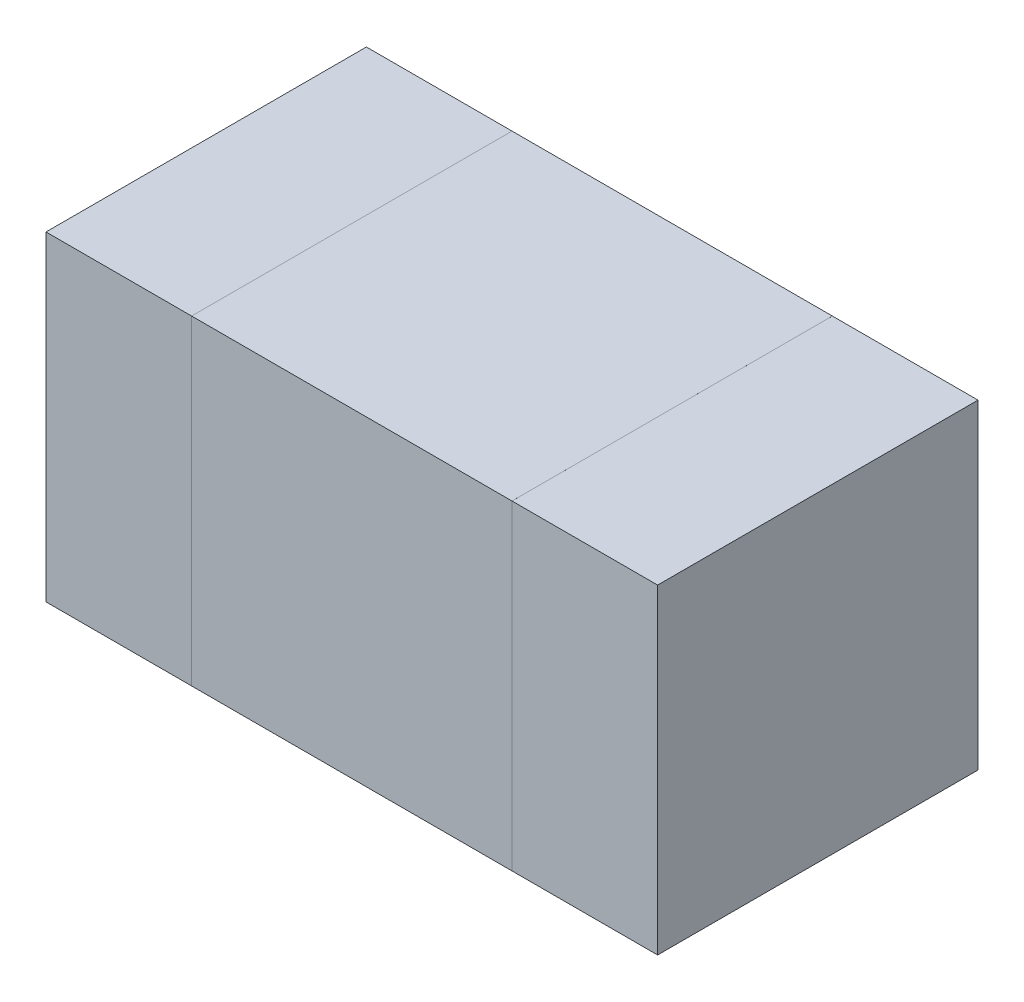
ISO-10303-21;
HEADER;
FILE_DESCRIPTION(('STEP AP214'),'2;1');
FILE_NAME('part.step','',(''),(''),'','','');
FILE_SCHEMA(('AUTOMOTIVE_DESIGN { 1 0 10303 214 1 1 1 1 }'));
ENDSEC;
DATA;
#1=APPLICATION_CONTEXT('core data for automotive mechanical design processes');
#2=APPLICATION_PROTOCOL_DEFINITION('international standard','automotive_design',2000,#1);
#3=PRODUCT_CONTEXT('',#1,'mechanical');
#4=PRODUCT('Part','Part','',(#3));
#5=PRODUCT_RELATED_PRODUCT_CATEGORY('part','',(#4));
#6=PRODUCT_DEFINITION_FORMATION('','',#4);
#7=PRODUCT_DEFINITION_CONTEXT('part definition',#1,'design');
#8=PRODUCT_DEFINITION('design','',#6,#7);
#9=PRODUCT_DEFINITION_SHAPE('','',#8);
#10=(LENGTH_UNIT() NAMED_UNIT(*) SI_UNIT(.MILLI.,.METRE.));
#11=(NAMED_UNIT(*) PLANE_ANGLE_UNIT() SI_UNIT($,.RADIAN.));
#12=(NAMED_UNIT(*) SI_UNIT($,.STERADIAN.) SOLID_ANGLE_UNIT());
#13=UNCERTAINTY_MEASURE_WITH_UNIT(LENGTH_MEASURE(1.E-05),#10,'distance_accuracy_value','');
#14=(GEOMETRIC_REPRESENTATION_CONTEXT(3) GLOBAL_UNCERTAINTY_ASSIGNED_CONTEXT((#13)) GLOBAL_UNIT_ASSIGNED_CONTEXT((#10,
#11,#12)) REPRESENTATION_CONTEXT('',''));
#15=CARTESIAN_POINT('',(0.,0.,0.));
#16=DIRECTION('',(0.,0.,1.));
#17=DIRECTION('',(1.,0.,0.));
#18=AXIS2_PLACEMENT_3D('',#15,#16,#17);
#19=CARTESIAN_POINT('',(5.860005851563,9.384998946074,0.32999934));
#20=DIRECTION('',(0.,0.,-1.));
#21=DIRECTION('',(0.,-1.,0.));
#22=AXIS2_PLACEMENT_3D('',#19,#20,#21);
#23=PLANE('',#22);
#24=DIRECTION('',(0.,1.,0.));
#25=VECTOR('',#24,1.);
#26=CARTESIAN_POINT('',(5.860005851563,9.384998946074,0.32999934));
#27=LINE('',#26,#25);
#28=CARTESIAN_POINT('',(5.860005851563,9.384998946074,0.32999934));
#29=VERTEX_POINT('',#28);
#30=CARTESIAN_POINT('',(5.860005851563,9.715000826074,0.32999934));
#31=VERTEX_POINT('',#30);
#32=EDGE_CURVE('P0_E97',#29,#31,#27,.T.);
#33=ORIENTED_EDGE('',*,*,#32,.T.);
#34=DIRECTION('',(-1.,0.,0.));
#35=VECTOR('',#34,1.);
#36=CARTESIAN_POINT('',(5.860005851563,9.715000826074,0.32999934));
#37=LINE('',#36,#35);
#38=CARTESIAN_POINT('',(5.710003611563,9.715000826074,0.32999934));
#39=VERTEX_POINT('',#38);
#40=EDGE_CURVE('P0_E77',#31,#39,#37,.T.);
#41=ORIENTED_EDGE('',*,*,#40,.T.);
#42=DIRECTION('',(0.,-1.,0.));
#43=VECTOR('',#42,1.);
#44=CARTESIAN_POINT('',(5.710003611563,9.715000826074,0.32999934));
#45=LINE('',#44,#43);
#46=CARTESIAN_POINT('',(5.710003611563,9.384998946074,0.32999934));
#47=VERTEX_POINT('',#46);
#48=EDGE_CURVE('P0_E82',#39,#47,#45,.T.);
#49=ORIENTED_EDGE('',*,*,#48,.T.);
#50=DIRECTION('',(1.,0.,0.));
#51=VECTOR('',#50,1.);
#52=CARTESIAN_POINT('',(5.710003611563,9.384998946074,0.32999934));
#53=LINE('',#52,#51);
#54=EDGE_CURVE('P0_E11',#47,#29,#53,.T.);
#55=ORIENTED_EDGE('',*,*,#54,.T.);
#56=EDGE_LOOP('',(#33,#41,#49,#55));
#57=FACE_BOUND('',#56,.T.);
#58=ADVANCED_FACE('P0_F17',(#57),#23,.F.);
#59=CARTESIAN_POINT('',(5.860005851563,9.384998946074,0.));
#60=DIRECTION('',(0.,0.,-1.));
#61=DIRECTION('',(0.,-1.,0.));
#62=AXIS2_PLACEMENT_3D('',#59,#60,#61);
#63=PLANE('',#62);
#64=DIRECTION('',(1.,0.,0.));
#65=VECTOR('',#64,1.);
#66=CARTESIAN_POINT('',(5.710003611563,9.384998946074,0.));
#67=LINE('',#66,#65);
#68=CARTESIAN_POINT('',(5.710003611563,9.384998946074,0.));
#69=VERTEX_POINT('',#68);
#70=CARTESIAN_POINT('',(5.860005851563,9.384998946074,0.));
#71=VERTEX_POINT('',#70);
#72=EDGE_CURVE('P0_E25',#69,#71,#67,.T.);
#73=ORIENTED_EDGE('',*,*,#72,.F.);
#74=DIRECTION('',(0.,-1.,0.));
#75=VECTOR('',#74,1.);
#76=CARTESIAN_POINT('',(5.710003611563,9.715000826074,0.));
#77=LINE('',#76,#75);
#78=CARTESIAN_POINT('',(5.710003611563,9.715000826074,0.));
#79=VERTEX_POINT('',#78);
#80=EDGE_CURVE('P0_E67',#79,#69,#77,.T.);
#81=ORIENTED_EDGE('',*,*,#80,.F.);
#82=DIRECTION('',(-1.,0.,0.));
#83=VECTOR('',#82,1.);
#84=CARTESIAN_POINT('',(5.860005851563,9.715000826074,0.));
#85=LINE('',#84,#83);
#86=CARTESIAN_POINT('',(5.860005851563,9.715000826074,0.));
#87=VERTEX_POINT('',#86);
#88=EDGE_CURVE('P0_E71',#87,#79,#85,.T.);
#89=ORIENTED_EDGE('',*,*,#88,.F.);
#90=DIRECTION('',(0.,1.,0.));
#91=VECTOR('',#90,1.);
#92=CARTESIAN_POINT('',(5.860005851563,9.384998946074,0.));
#93=LINE('',#92,#91);
#94=EDGE_CURVE('P0_E101',#71,#87,#93,.T.);
#95=ORIENTED_EDGE('',*,*,#94,.F.);
#96=EDGE_LOOP('',(#73,#81,#89,#95));
#97=FACE_BOUND('',#96,.T.);
#98=ADVANCED_FACE('P0_F69',(#97),#63,.T.);
#99=CARTESIAN_POINT('',(5.710003611563,9.384998946074,0.));
#100=DIRECTION('',(0.,1.,0.));
#101=DIRECTION('',(1.,0.,0.));
#102=AXIS2_PLACEMENT_3D('',#99,#100,#101);
#103=PLANE('',#102);
#104=ORIENTED_EDGE('',*,*,#72,.T.);
#105=DIRECTION('',(0.,0.,1.));
#106=VECTOR('',#105,1.);
#107=CARTESIAN_POINT('',(5.860005851563,9.384998946074,0.));
#108=LINE('',#107,#106);
#109=EDGE_CURVE('P0_E92',#71,#29,#108,.T.);
#110=ORIENTED_EDGE('',*,*,#109,.T.);
#111=ORIENTED_EDGE('',*,*,#54,.F.);
#112=DIRECTION('',(0.,0.,1.));
#113=VECTOR('',#112,1.);
#114=CARTESIAN_POINT('',(5.710003611563,9.384998946074,0.));
#115=LINE('',#114,#113);
#116=EDGE_CURVE('P0_E76',#69,#47,#115,.T.);
#117=ORIENTED_EDGE('',*,*,#116,.F.);
#118=EDGE_LOOP('',(#104,#110,#111,#117));
#119=FACE_BOUND('',#118,.T.);
#120=ADVANCED_FACE('P0_F115',(#119),#103,.F.);
#121=CARTESIAN_POINT('',(5.710003611563,9.715000826074,0.));
#122=DIRECTION('',(1.,0.,0.));
#123=DIRECTION('',(0.,1.,0.));
#124=AXIS2_PLACEMENT_3D('',#121,#122,#123);
#125=PLANE('',#124);
#126=ORIENTED_EDGE('',*,*,#80,.T.);
#127=ORIENTED_EDGE('',*,*,#116,.T.);
#128=ORIENTED_EDGE('',*,*,#48,.F.);
#129=DIRECTION('',(0.,0.,1.));
#130=VECTOR('',#129,1.);
#131=CARTESIAN_POINT('',(5.710003611563,9.715000826074,0.));
#132=LINE('',#131,#130);
#133=EDGE_CURVE('P0_E80',#79,#39,#132,.T.);
#134=ORIENTED_EDGE('',*,*,#133,.F.);
#135=EDGE_LOOP('',(#126,#127,#128,#134));
#136=FACE_BOUND('',#135,.T.);
#137=ADVANCED_FACE('P0_F81',(#136),#125,.F.);
#138=CARTESIAN_POINT('',(5.860005851563,9.715000826074,0.));
#139=DIRECTION('',(0.,-1.,0.));
#140=DIRECTION('',(0.,0.,-1.));
#141=AXIS2_PLACEMENT_3D('',#138,#139,#140);
#142=PLANE('',#141);
#143=ORIENTED_EDGE('',*,*,#88,.T.);
#144=ORIENTED_EDGE('',*,*,#133,.T.);
#145=ORIENTED_EDGE('',*,*,#40,.F.);
#146=DIRECTION('',(0.,0.,1.));
#147=VECTOR('',#146,1.);
#148=CARTESIAN_POINT('',(5.860005851563,9.715000826074,0.));
#149=LINE('',#148,#147);
#150=EDGE_CURVE('P0_E89',#87,#31,#149,.T.);
#151=ORIENTED_EDGE('',*,*,#150,.F.);
#152=EDGE_LOOP('',(#143,#144,#145,#151));
#153=FACE_BOUND('',#152,.T.);
#154=ADVANCED_FACE('P0_F87',(#153),#142,.F.);
#155=CARTESIAN_POINT('',(5.860005851563,9.384998946074,0.));
#156=DIRECTION('',(-1.,0.,0.));
#157=DIRECTION('',(0.,0.,1.));
#158=AXIS2_PLACEMENT_3D('',#155,#156,#157);
#159=PLANE('',#158);
#160=ORIENTED_EDGE('',*,*,#94,.T.);
#161=ORIENTED_EDGE('',*,*,#150,.T.);
#162=ORIENTED_EDGE('',*,*,#32,.F.);
#163=ORIENTED_EDGE('',*,*,#109,.F.);
#164=EDGE_LOOP('',(#160,#161,#162,#163));
#165=FACE_BOUND('',#164,.T.);
#166=ADVANCED_FACE('P0_F118',(#165),#159,.F.);
#167=CLOSED_SHELL('',(#58,#98,#120,#137,#154,#166));
#168=MANIFOLD_SOLID_BREP('P0_B1',#167);
#169=CARTESIAN_POINT('',(6.340001579102,9.384998946074,0.32999934));
#170=DIRECTION('',(0.,0.,-1.));
#171=DIRECTION('',(0.,-1.,0.));
#172=AXIS2_PLACEMENT_3D('',#169,#170,#171);
#173=PLANE('',#172);
#174=DIRECTION('',(0.,1.,0.));
#175=VECTOR('',#174,1.);
#176=CARTESIAN_POINT('',(6.340001579102,9.384998946074,0.32999934));
#177=LINE('',#176,#175);
#178=CARTESIAN_POINT('',(6.340001579102,9.384998946074,0.32999934));
#179=VERTEX_POINT('',#178);
#180=CARTESIAN_POINT('',(6.340001579102,9.715000826074,0.32999934));
#181=VERTEX_POINT('',#180);
#182=EDGE_CURVE('P1_E83',#179,#181,#177,.T.);
#183=ORIENTED_EDGE('',*,*,#182,.T.);
#184=DIRECTION('',(-1.,0.,0.));
#185=VECTOR('',#184,1.);
#186=CARTESIAN_POINT('',(6.340001579102,9.715000826074,0.32999934));
#187=LINE('',#186,#185);
#188=CARTESIAN_POINT('',(6.189999339102,9.715000826074,0.32999934));
#189=VERTEX_POINT('',#188);
#190=EDGE_CURVE('P1_E105',#181,#189,#187,.T.);
#191=ORIENTED_EDGE('',*,*,#190,.T.);
#192=DIRECTION('',(0.,-1.,0.));
#193=VECTOR('',#192,1.);
#194=CARTESIAN_POINT('',(6.189999339102,9.715000826074,0.32999934));
#195=LINE('',#194,#193);
#196=CARTESIAN_POINT('',(6.189999339102,9.384998946074,0.32999934));
#197=VERTEX_POINT('',#196);
#198=EDGE_CURVE('P1_E20',#189,#197,#195,.T.);
#199=ORIENTED_EDGE('',*,*,#198,.T.);
#200=DIRECTION('',(1.,0.,0.));
#201=VECTOR('',#200,1.);
#202=CARTESIAN_POINT('',(6.189999339102,9.384998946074,0.32999934));
#203=LINE('',#202,#201);
#204=EDGE_CURVE('P1_E11',#197,#179,#203,.T.);
#205=ORIENTED_EDGE('',*,*,#204,.T.);
#206=EDGE_LOOP('',(#183,#191,#199,#205));
#207=FACE_BOUND('',#206,.T.);
#208=ADVANCED_FACE('P1_F17',(#207),#173,.F.);
#209=CARTESIAN_POINT('',(6.340001579102,9.384998946074,0.));
#210=DIRECTION('',(0.,0.,-1.));
#211=DIRECTION('',(0.,-1.,0.));
#212=AXIS2_PLACEMENT_3D('',#209,#210,#211);
#213=PLANE('',#212);
#214=DIRECTION('',(1.,0.,0.));
#215=VECTOR('',#214,1.);
#216=CARTESIAN_POINT('',(6.189999339102,9.384998946074,0.));
#217=LINE('',#216,#215);
#218=CARTESIAN_POINT('',(6.189999339102,9.384998946074,0.));
#219=VERTEX_POINT('',#218);
#220=CARTESIAN_POINT('',(6.340001579102,9.384998946074,0.));
#221=VERTEX_POINT('',#220);
#222=EDGE_CURVE('P1_E26',#219,#221,#217,.T.);
#223=ORIENTED_EDGE('',*,*,#222,.F.);
#224=DIRECTION('',(0.,-1.,0.));
#225=VECTOR('',#224,1.);
#226=CARTESIAN_POINT('',(6.189999339102,9.715000826074,0.));
#227=LINE('',#226,#225);
#228=CARTESIAN_POINT('',(6.189999339102,9.715000826074,0.));
#229=VERTEX_POINT('',#228);
#230=EDGE_CURVE('P1_E109',#229,#219,#227,.T.);
#231=ORIENTED_EDGE('',*,*,#230,.F.);
#232=DIRECTION('',(-1.,0.,0.));
#233=VECTOR('',#232,1.);
#234=CARTESIAN_POINT('',(6.340001579102,9.715000826074,0.));
#235=LINE('',#234,#233);
#236=CARTESIAN_POINT('',(6.340001579102,9.715000826074,0.));
#237=VERTEX_POINT('',#236);
#238=EDGE_CURVE('P1_E85',#237,#229,#235,.T.);
#239=ORIENTED_EDGE('',*,*,#238,.F.);
#240=DIRECTION('',(0.,1.,0.));
#241=VECTOR('',#240,1.);
#242=CARTESIAN_POINT('',(6.340001579102,9.384998946074,0.));
#243=LINE('',#242,#241);
#244=EDGE_CURVE('P1_E81',#221,#237,#243,.T.);
#245=ORIENTED_EDGE('',*,*,#244,.F.);
#246=EDGE_LOOP('',(#223,#231,#239,#245));
#247=FACE_BOUND('',#246,.T.);
#248=ADVANCED_FACE('P1_F87',(#247),#213,.T.);
#249=CARTESIAN_POINT('',(6.189999339102,9.384998946074,0.));
#250=DIRECTION('',(0.,1.,0.));
#251=DIRECTION('',(1.,0.,0.));
#252=AXIS2_PLACEMENT_3D('',#249,#250,#251);
#253=PLANE('',#252);
#254=ORIENTED_EDGE('',*,*,#222,.T.);
#255=DIRECTION('',(0.,0.,1.));
#256=VECTOR('',#255,1.);
#257=CARTESIAN_POINT('',(6.340001579102,9.384998946074,0.));
#258=LINE('',#257,#256);
#259=EDGE_CURVE('P1_E70',#221,#179,#258,.T.);
#260=ORIENTED_EDGE('',*,*,#259,.T.);
#261=ORIENTED_EDGE('',*,*,#204,.F.);
#262=DIRECTION('',(0.,0.,1.));
#263=VECTOR('',#262,1.);
#264=CARTESIAN_POINT('',(6.189999339102,9.384998946074,0.));
#265=LINE('',#264,#263);
#266=EDGE_CURVE('P1_E73',#219,#197,#265,.T.);
#267=ORIENTED_EDGE('',*,*,#266,.F.);
#268=EDGE_LOOP('',(#254,#260,#261,#267));
#269=FACE_BOUND('',#268,.T.);
#270=ADVANCED_FACE('P1_F69',(#269),#253,.F.);
#271=CARTESIAN_POINT('',(6.189999339102,9.715000826074,0.));
#272=DIRECTION('',(1.,0.,0.));
#273=DIRECTION('',(0.,1.,0.));
#274=AXIS2_PLACEMENT_3D('',#271,#272,#273);
#275=PLANE('',#274);
#276=ORIENTED_EDGE('',*,*,#230,.T.);
#277=ORIENTED_EDGE('',*,*,#266,.T.);
#278=ORIENTED_EDGE('',*,*,#198,.F.);
#279=DIRECTION('',(0.,0.,1.));
#280=VECTOR('',#279,1.);
#281=CARTESIAN_POINT('',(6.189999339102,9.715000826074,0.));
#282=LINE('',#281,#280);
#283=EDGE_CURVE('P1_E101',#229,#189,#282,.T.);
#284=ORIENTED_EDGE('',*,*,#283,.F.);
#285=EDGE_LOOP('',(#276,#277,#278,#284));
#286=FACE_BOUND('',#285,.T.);
#287=ADVANCED_FACE('P1_F119',(#286),#275,.F.);
#288=CARTESIAN_POINT('',(6.340001579102,9.715000826074,0.));
#289=DIRECTION('',(0.,-1.,0.));
#290=DIRECTION('',(0.,0.,-1.));
#291=AXIS2_PLACEMENT_3D('',#288,#289,#290);
#292=PLANE('',#291);
#293=ORIENTED_EDGE('',*,*,#238,.T.);
#294=ORIENTED_EDGE('',*,*,#283,.T.);
#295=ORIENTED_EDGE('',*,*,#190,.F.);
#296=DIRECTION('',(0.,0.,1.));
#297=VECTOR('',#296,1.);
#298=CARTESIAN_POINT('',(6.340001579102,9.715000826074,0.));
#299=LINE('',#298,#297);
#300=EDGE_CURVE('P1_E91',#237,#181,#299,.T.);
#301=ORIENTED_EDGE('',*,*,#300,.F.);
#302=EDGE_LOOP('',(#293,#294,#295,#301));
#303=FACE_BOUND('',#302,.T.);
#304=ADVANCED_FACE('P1_F121',(#303),#292,.F.);
#305=CARTESIAN_POINT('',(6.340001579102,9.384998946074,0.));
#306=DIRECTION('',(-1.,0.,0.));
#307=DIRECTION('',(0.,0.,1.));
#308=AXIS2_PLACEMENT_3D('',#305,#306,#307);
#309=PLANE('',#308);
#310=ORIENTED_EDGE('',*,*,#244,.T.);
#311=ORIENTED_EDGE('',*,*,#300,.T.);
#312=ORIENTED_EDGE('',*,*,#182,.F.);
#313=ORIENTED_EDGE('',*,*,#259,.F.);
#314=EDGE_LOOP('',(#310,#311,#312,#313));
#315=FACE_BOUND('',#314,.T.);
#316=ADVANCED_FACE('P1_F79',(#315),#309,.F.);
#317=CLOSED_SHELL('',(#208,#248,#270,#287,#304,#316));
#318=MANIFOLD_SOLID_BREP('P1_B1',#317);
#319=CARTESIAN_POINT('',(5.859994025938,9.385001486074,0.32999934));
#320=DIRECTION('',(0.,0.,-1.));
#321=DIRECTION('',(0.,-1.,0.));
#322=AXIS2_PLACEMENT_3D('',#319,#320,#321);
#323=PLANE('',#322);
#324=DIRECTION('',(1.,0.,0.));
#325=VECTOR('',#324,1.);
#326=CARTESIAN_POINT('',(5.859994025938,9.385001486074,0.32999934));
#327=LINE('',#326,#325);
#328=CARTESIAN_POINT('',(5.859994025938,9.385001486074,0.32999934));
#329=VERTEX_POINT('',#328);
#330=CARTESIAN_POINT('',(6.189995905938,9.385001486074,0.32999934));
#331=VERTEX_POINT('',#330);
#332=EDGE_CURVE('P2_E79',#329,#331,#327,.T.);
#333=ORIENTED_EDGE('',*,*,#332,.T.);
#334=DIRECTION('',(0.,1.,0.));
#335=VECTOR('',#334,1.);
#336=CARTESIAN_POINT('',(6.189995905938,9.385001486074,0.32999934));
#337=LINE('',#336,#335);
#338=CARTESIAN_POINT('',(6.189995905938,9.715000826074,0.32999934));
#339=VERTEX_POINT('',#338);
#340=EDGE_CURVE('P2_E77',#331,#339,#337,.T.);
#341=ORIENTED_EDGE('',*,*,#340,.T.);
#342=DIRECTION('',(-1.,0.,0.));
#343=VECTOR('',#342,1.);
#344=CARTESIAN_POINT('',(6.189995905938,9.715000826074,0.32999934));
#345=LINE('',#344,#343);
#346=CARTESIAN_POINT('',(5.859994025938,9.715000826074,0.32999934));
#347=VERTEX_POINT('',#346);
#348=EDGE_CURVE('P2_E65',#339,#347,#345,.T.);
#349=ORIENTED_EDGE('',*,*,#348,.T.);
#350=DIRECTION('',(0.,-1.,0.));
#351=VECTOR('',#350,1.);
#352=CARTESIAN_POINT('',(5.859994025938,9.715000826074,0.32999934));
#353=LINE('',#352,#351);
#354=EDGE_CURVE('P2_E11',#347,#329,#353,.T.);
#355=ORIENTED_EDGE('',*,*,#354,.T.);
#356=EDGE_LOOP('',(#333,#341,#349,#355));
#357=FACE_BOUND('',#356,.T.);
#358=ADVANCED_FACE('P2_F17',(#357),#323,.F.);
#359=CARTESIAN_POINT('',(5.859994025938,9.385001486074,0.));
#360=DIRECTION('',(0.,0.,-1.));
#361=DIRECTION('',(0.,-1.,0.));
#362=AXIS2_PLACEMENT_3D('',#359,#360,#361);
#363=PLANE('',#362);
#364=DIRECTION('',(0.,-1.,0.));
#365=VECTOR('',#364,1.);
#366=CARTESIAN_POINT('',(5.859994025938,9.715000826074,0.));
#367=LINE('',#366,#365);
#368=CARTESIAN_POINT('',(5.859994025938,9.715000826074,0.));
#369=VERTEX_POINT('',#368);
#370=CARTESIAN_POINT('',(5.859994025938,9.385001486074,0.));
#371=VERTEX_POINT('',#370);
#372=EDGE_CURVE('P2_E26',#369,#371,#367,.T.);
#373=ORIENTED_EDGE('',*,*,#372,.F.);
#374=DIRECTION('',(-1.,0.,0.));
#375=VECTOR('',#374,1.);
#376=CARTESIAN_POINT('',(6.189995905938,9.715000826074,0.));
#377=LINE('',#376,#375);
#378=CARTESIAN_POINT('',(6.189995905938,9.715000826074,0.));
#379=VERTEX_POINT('',#378);
#380=EDGE_CURVE('P2_E84',#379,#369,#377,.T.);
#381=ORIENTED_EDGE('',*,*,#380,.F.);
#382=DIRECTION('',(0.,1.,0.));
#383=VECTOR('',#382,1.);
#384=CARTESIAN_POINT('',(6.189995905938,9.385001486074,0.));
#385=LINE('',#384,#383);
#386=CARTESIAN_POINT('',(6.189995905938,9.385001486074,0.));
#387=VERTEX_POINT('',#386);
#388=EDGE_CURVE('P2_E87',#387,#379,#385,.T.);
#389=ORIENTED_EDGE('',*,*,#388,.F.);
#390=DIRECTION('',(1.,0.,0.));
#391=VECTOR('',#390,1.);
#392=CARTESIAN_POINT('',(5.859994025938,9.385001486074,0.));
#393=LINE('',#392,#391);
#394=EDGE_CURVE('P2_E113',#371,#387,#393,.T.);
#395=ORIENTED_EDGE('',*,*,#394,.F.);
#396=EDGE_LOOP('',(#373,#381,#389,#395));
#397=FACE_BOUND('',#396,.T.);
#398=ADVANCED_FACE('P2_F116',(#397),#363,.T.);
#399=CARTESIAN_POINT('',(5.859994025938,9.715000826074,0.));
#400=DIRECTION('',(1.,0.,0.));
#401=DIRECTION('',(0.,1.,0.));
#402=AXIS2_PLACEMENT_3D('',#399,#400,#401);
#403=PLANE('',#402);
#404=ORIENTED_EDGE('',*,*,#372,.T.);
#405=DIRECTION('',(0.,0.,1.));
#406=VECTOR('',#405,1.);
#407=CARTESIAN_POINT('',(5.859994025938,9.385001486074,0.));
#408=LINE('',#407,#406);
#409=EDGE_CURVE('P2_E94',#371,#329,#408,.T.);
#410=ORIENTED_EDGE('',*,*,#409,.T.);
#411=ORIENTED_EDGE('',*,*,#354,.F.);
#412=DIRECTION('',(0.,0.,1.));
#413=VECTOR('',#412,1.);
#414=CARTESIAN_POINT('',(5.859994025938,9.715000826074,0.));
#415=LINE('',#414,#413);
#416=EDGE_CURVE('P2_E72',#369,#347,#415,.T.);
#417=ORIENTED_EDGE('',*,*,#416,.F.);
#418=EDGE_LOOP('',(#404,#410,#411,#417));
#419=FACE_BOUND('',#418,.T.);
#420=ADVANCED_FACE('P2_F107',(#419),#403,.F.);
#421=CARTESIAN_POINT('',(6.189995905938,9.715000826074,0.));
#422=DIRECTION('',(0.,-1.,0.));
#423=DIRECTION('',(0.,0.,-1.));
#424=AXIS2_PLACEMENT_3D('',#421,#422,#423);
#425=PLANE('',#424);
#426=ORIENTED_EDGE('',*,*,#380,.T.);
#427=ORIENTED_EDGE('',*,*,#416,.T.);
#428=ORIENTED_EDGE('',*,*,#348,.F.);
#429=DIRECTION('',(0.,0.,1.));
#430=VECTOR('',#429,1.);
#431=CARTESIAN_POINT('',(6.189995905938,9.715000826074,0.));
#432=LINE('',#431,#430);
#433=EDGE_CURVE('P2_E70',#379,#339,#432,.T.);
#434=ORIENTED_EDGE('',*,*,#433,.F.);
#435=EDGE_LOOP('',(#426,#427,#428,#434));
#436=FACE_BOUND('',#435,.T.);
#437=ADVANCED_FACE('P2_F68',(#436),#425,.F.);
#438=CARTESIAN_POINT('',(6.189995905938,9.385001486074,0.));
#439=DIRECTION('',(-1.,0.,0.));
#440=DIRECTION('',(0.,0.,1.));
#441=AXIS2_PLACEMENT_3D('',#438,#439,#440);
#442=PLANE('',#441);
#443=ORIENTED_EDGE('',*,*,#388,.T.);
#444=ORIENTED_EDGE('',*,*,#433,.T.);
#445=ORIENTED_EDGE('',*,*,#340,.F.);
#446=DIRECTION('',(0.,0.,1.));
#447=VECTOR('',#446,1.);
#448=CARTESIAN_POINT('',(6.189995905938,9.385001486074,0.));
#449=LINE('',#448,#447);
#450=EDGE_CURVE('P2_E98',#387,#331,#449,.T.);
#451=ORIENTED_EDGE('',*,*,#450,.F.);
#452=EDGE_LOOP('',(#443,#444,#445,#451));
#453=FACE_BOUND('',#452,.T.);
#454=ADVANCED_FACE('P2_F86',(#453),#442,.F.);
#455=CARTESIAN_POINT('',(5.859994025938,9.385001486074,0.));
#456=DIRECTION('',(0.,1.,0.));
#457=DIRECTION('',(1.,0.,0.));
#458=AXIS2_PLACEMENT_3D('',#455,#456,#457);
#459=PLANE('',#458);
#460=ORIENTED_EDGE('',*,*,#394,.T.);
#461=ORIENTED_EDGE('',*,*,#450,.T.);
#462=ORIENTED_EDGE('',*,*,#332,.F.);
#463=ORIENTED_EDGE('',*,*,#409,.F.);
#464=EDGE_LOOP('',(#460,#461,#462,#463));
#465=FACE_BOUND('',#464,.T.);
#466=ADVANCED_FACE('P2_F112',(#465),#459,.F.);
#467=CLOSED_SHELL('',(#358,#398,#420,#437,#454,#466));
#468=MANIFOLD_SOLID_BREP('P2_B1',#467);
#469=ADVANCED_BREP_SHAPE_REPRESENTATION('',(#18,#168,#318,#468),#14);
#470=SHAPE_DEFINITION_REPRESENTATION(#9,#469);
ENDSEC;
END-ISO-10303-21;
